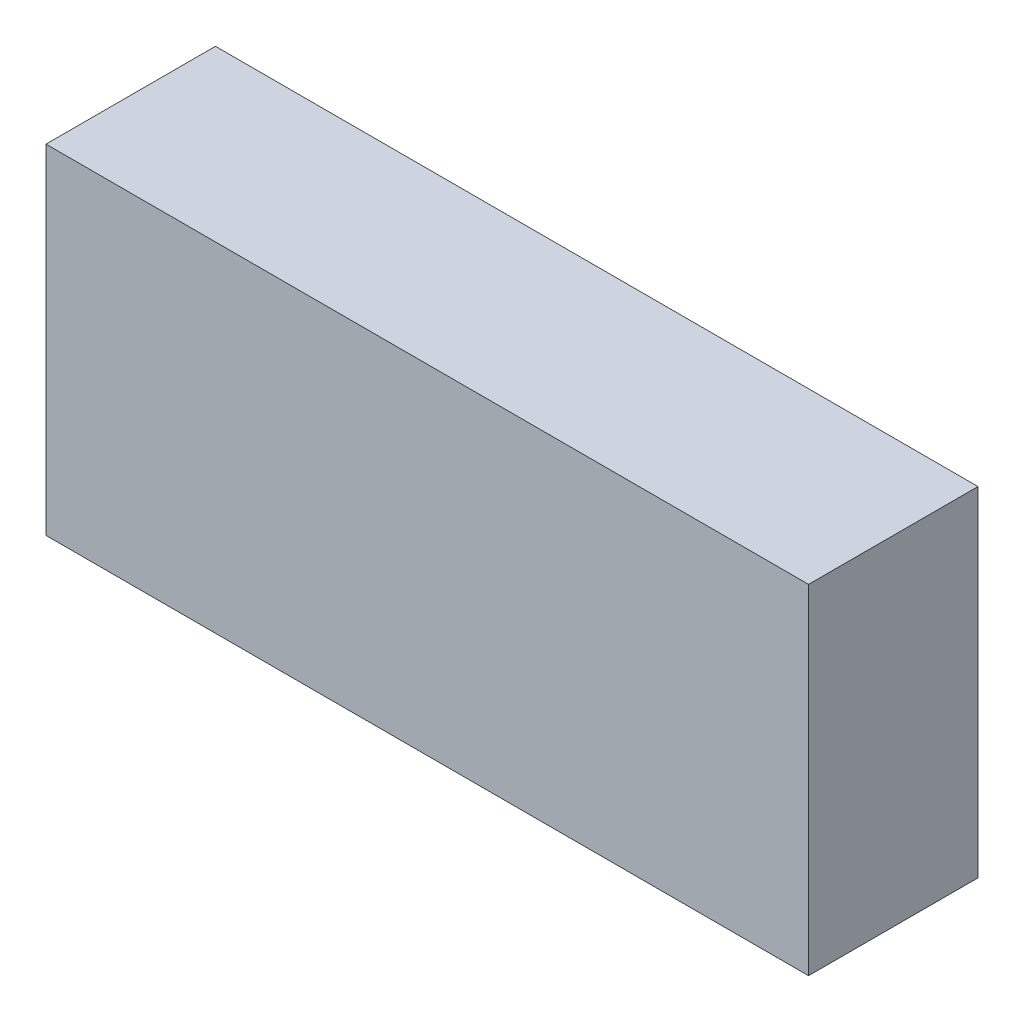
ISO-10303-21;
HEADER;
FILE_DESCRIPTION(('STEP AP214'),'2;1');
FILE_NAME('part.step','',(''),(''),'','','');
FILE_SCHEMA(('AUTOMOTIVE_DESIGN { 1 0 10303 214 1 1 1 1 }'));
ENDSEC;
DATA;
#1=APPLICATION_CONTEXT('core data for automotive mechanical design processes');
#2=APPLICATION_PROTOCOL_DEFINITION('international standard','automotive_design',2000,#1);
#3=PRODUCT_CONTEXT('',#1,'mechanical');
#4=PRODUCT('Part','Part','',(#3));
#5=PRODUCT_RELATED_PRODUCT_CATEGORY('part','',(#4));
#6=PRODUCT_DEFINITION_FORMATION('','',#4);
#7=PRODUCT_DEFINITION_CONTEXT('part definition',#1,'design');
#8=PRODUCT_DEFINITION('design','',#6,#7);
#9=PRODUCT_DEFINITION_SHAPE('','',#8);
#10=(LENGTH_UNIT() NAMED_UNIT(*) SI_UNIT(.MILLI.,.METRE.));
#11=(NAMED_UNIT(*) PLANE_ANGLE_UNIT() SI_UNIT($,.RADIAN.));
#12=(NAMED_UNIT(*) SI_UNIT($,.STERADIAN.) SOLID_ANGLE_UNIT());
#13=UNCERTAINTY_MEASURE_WITH_UNIT(LENGTH_MEASURE(1.E-05),#10,'distance_accuracy_value','');
#14=(GEOMETRIC_REPRESENTATION_CONTEXT(3) GLOBAL_UNCERTAINTY_ASSIGNED_CONTEXT((#13)) GLOBAL_UNIT_ASSIGNED_CONTEXT((#10,
#11,#12)) REPRESENTATION_CONTEXT('',''));
#15=CARTESIAN_POINT('',(0.,0.,0.));
#16=DIRECTION('',(0.,0.,1.));
#17=DIRECTION('',(1.,0.,0.));
#18=AXIS2_PLACEMENT_3D('',#15,#16,#17);
#19=CARTESIAN_POINT('',(0.,0.,25.4));
#20=DIRECTION('',(1.,0.,0.));
#21=DIRECTION('',(0.,0.,-1.));
#22=AXIS2_PLACEMENT_3D('',#19,#20,#21);
#23=PLANE('',#22);
#24=DIRECTION('',(0.,-1.,0.));
#25=VECTOR('',#24,1.);
#26=CARTESIAN_POINT('',(0.,0.,0.));
#27=LINE('',#26,#25);
#28=CARTESIAN_POINT('',(0.,50.8,0.));
#29=VERTEX_POINT('',#28);
#30=CARTESIAN_POINT('',(0.,0.,0.));
#31=VERTEX_POINT('',#30);
#32=EDGE_CURVE('E96',#29,#31,#27,.T.);
#33=ORIENTED_EDGE('',*,*,#32,.T.);
#34=DIRECTION('',(0.,0.,-1.));
#35=VECTOR('',#34,1.);
#36=CARTESIAN_POINT('',(0.,0.,25.4));
#37=LINE('',#36,#35);
#38=CARTESIAN_POINT('',(0.,0.,25.4));
#39=VERTEX_POINT('',#38);
#40=EDGE_CURVE('E11',#39,#31,#37,.T.);
#41=ORIENTED_EDGE('',*,*,#40,.F.);
#42=DIRECTION('',(0.,-1.,0.));
#43=VECTOR('',#42,1.);
#44=CARTESIAN_POINT('',(0.,0.,25.4));
#45=LINE('',#44,#43);
#46=CARTESIAN_POINT('',(0.,50.8,25.4));
#47=VERTEX_POINT('',#46);
#48=EDGE_CURVE('E84',#47,#39,#45,.T.);
#49=ORIENTED_EDGE('',*,*,#48,.F.);
#50=DIRECTION('',(0.,0.,-1.));
#51=VECTOR('',#50,1.);
#52=CARTESIAN_POINT('',(0.,50.8,25.4));
#53=LINE('',#52,#51);
#54=EDGE_CURVE('E92',#47,#29,#53,.T.);
#55=ORIENTED_EDGE('',*,*,#54,.T.);
#56=EDGE_LOOP('',(#33,#41,#49,#55));
#57=FACE_BOUND('',#56,.T.);
#58=ADVANCED_FACE('F33',(#57),#23,.F.);
#59=CARTESIAN_POINT('',(0.,0.,25.4));
#60=DIRECTION('',(0.,1.,0.));
#61=DIRECTION('',(0.,0.,1.));
#62=AXIS2_PLACEMENT_3D('',#59,#60,#61);
#63=PLANE('',#62);
#64=DIRECTION('',(1.,0.,0.));
#65=VECTOR('',#64,1.);
#66=CARTESIAN_POINT('',(0.,0.,0.));
#67=LINE('',#66,#65);
#68=CARTESIAN_POINT('',(114.3,0.,0.));
#69=VERTEX_POINT('',#68);
#70=EDGE_CURVE('E88',#31,#69,#67,.T.);
#71=ORIENTED_EDGE('',*,*,#70,.T.);
#72=DIRECTION('',(0.,0.,-1.));
#73=VECTOR('',#72,1.);
#74=CARTESIAN_POINT('',(114.3,0.,25.4));
#75=LINE('',#74,#73);
#76=CARTESIAN_POINT('',(114.3,0.,25.4));
#77=VERTEX_POINT('',#76);
#78=EDGE_CURVE('E41',#77,#69,#75,.T.);
#79=ORIENTED_EDGE('',*,*,#78,.F.);
#80=DIRECTION('',(1.,0.,0.));
#81=VECTOR('',#80,1.);
#82=CARTESIAN_POINT('',(0.,0.,25.4));
#83=LINE('',#82,#81);
#84=EDGE_CURVE('E79',#39,#77,#83,.T.);
#85=ORIENTED_EDGE('',*,*,#84,.F.);
#86=ORIENTED_EDGE('',*,*,#40,.T.);
#87=EDGE_LOOP('',(#71,#79,#85,#86));
#88=FACE_BOUND('',#87,.T.);
#89=ADVANCED_FACE('F87',(#88),#63,.F.);
#90=CARTESIAN_POINT('',(114.3,0.,25.4));
#91=DIRECTION('',(-1.,0.,0.));
#92=DIRECTION('',(0.,0.,1.));
#93=AXIS2_PLACEMENT_3D('',#90,#91,#92);
#94=PLANE('',#93);
#95=DIRECTION('',(0.,1.,0.));
#96=VECTOR('',#95,1.);
#97=CARTESIAN_POINT('',(114.3,0.,0.));
#98=LINE('',#97,#96);
#99=CARTESIAN_POINT('',(114.3,50.8,0.));
#100=VERTEX_POINT('',#99);
#101=EDGE_CURVE('E66',#69,#100,#98,.T.);
#102=ORIENTED_EDGE('',*,*,#101,.T.);
#103=DIRECTION('',(0.,0.,-1.));
#104=VECTOR('',#103,1.);
#105=CARTESIAN_POINT('',(114.3,50.8,25.4));
#106=LINE('',#105,#104);
#107=CARTESIAN_POINT('',(114.3,50.8,25.4));
#108=VERTEX_POINT('',#107);
#109=EDGE_CURVE('E89',#108,#100,#106,.T.);
#110=ORIENTED_EDGE('',*,*,#109,.F.);
#111=DIRECTION('',(0.,1.,0.));
#112=VECTOR('',#111,1.);
#113=CARTESIAN_POINT('',(114.3,0.,25.4));
#114=LINE('',#113,#112);
#115=EDGE_CURVE('E82',#77,#108,#114,.T.);
#116=ORIENTED_EDGE('',*,*,#115,.F.);
#117=ORIENTED_EDGE('',*,*,#78,.T.);
#118=EDGE_LOOP('',(#102,#110,#116,#117));
#119=FACE_BOUND('',#118,.T.);
#120=ADVANCED_FACE('F90',(#119),#94,.F.);
#121=CARTESIAN_POINT('',(0.,50.8,25.4));
#122=DIRECTION('',(0.,-1.,0.));
#123=DIRECTION('',(0.,0.,-1.));
#124=AXIS2_PLACEMENT_3D('',#121,#122,#123);
#125=PLANE('',#124);
#126=DIRECTION('',(-1.,0.,0.));
#127=VECTOR('',#126,1.);
#128=CARTESIAN_POINT('',(0.,50.8,0.));
#129=LINE('',#128,#127);
#130=EDGE_CURVE('E72',#100,#29,#129,.T.);
#131=ORIENTED_EDGE('',*,*,#130,.T.);
#132=ORIENTED_EDGE('',*,*,#54,.F.);
#133=DIRECTION('',(-1.,0.,0.));
#134=VECTOR('',#133,1.);
#135=CARTESIAN_POINT('',(0.,50.8,25.4));
#136=LINE('',#135,#134);
#137=EDGE_CURVE('E49',#108,#47,#136,.T.);
#138=ORIENTED_EDGE('',*,*,#137,.F.);
#139=ORIENTED_EDGE('',*,*,#109,.T.);
#140=EDGE_LOOP('',(#131,#132,#138,#139));
#141=FACE_BOUND('',#140,.T.);
#142=ADVANCED_FACE('F103',(#141),#125,.F.);
#143=CARTESIAN_POINT('',(0.,0.,25.4));
#144=DIRECTION('',(0.,0.,-1.));
#145=DIRECTION('',(-1.,0.,0.));
#146=AXIS2_PLACEMENT_3D('',#143,#144,#145);
#147=PLANE('',#146);
#148=ORIENTED_EDGE('',*,*,#48,.T.);
#149=ORIENTED_EDGE('',*,*,#84,.T.);
#150=ORIENTED_EDGE('',*,*,#115,.T.);
#151=ORIENTED_EDGE('',*,*,#137,.T.);
#152=EDGE_LOOP('',(#148,#149,#150,#151));
#153=FACE_BOUND('',#152,.T.);
#154=ADVANCED_FACE('F80',(#153),#147,.F.);
#155=CARTESIAN_POINT('',(0.,0.,0.));
#156=DIRECTION('',(0.,0.,-1.));
#157=DIRECTION('',(-1.,0.,0.));
#158=AXIS2_PLACEMENT_3D('',#155,#156,#157);
#159=PLANE('',#158);
#160=ORIENTED_EDGE('',*,*,#32,.F.);
#161=ORIENTED_EDGE('',*,*,#130,.F.);
#162=ORIENTED_EDGE('',*,*,#101,.F.);
#163=ORIENTED_EDGE('',*,*,#70,.F.);
#164=EDGE_LOOP('',(#160,#161,#162,#163));
#165=FACE_BOUND('',#164,.T.);
#166=ADVANCED_FACE('F106',(#165),#159,.T.);
#167=CLOSED_SHELL('',(#58,#89,#120,#142,#154,#166));
#168=MANIFOLD_SOLID_BREP('B2',#167);
#169=ADVANCED_BREP_SHAPE_REPRESENTATION('',(#18,#168),#14);
#170=SHAPE_DEFINITION_REPRESENTATION(#9,#169);
ENDSEC;
END-ISO-10303-21;
